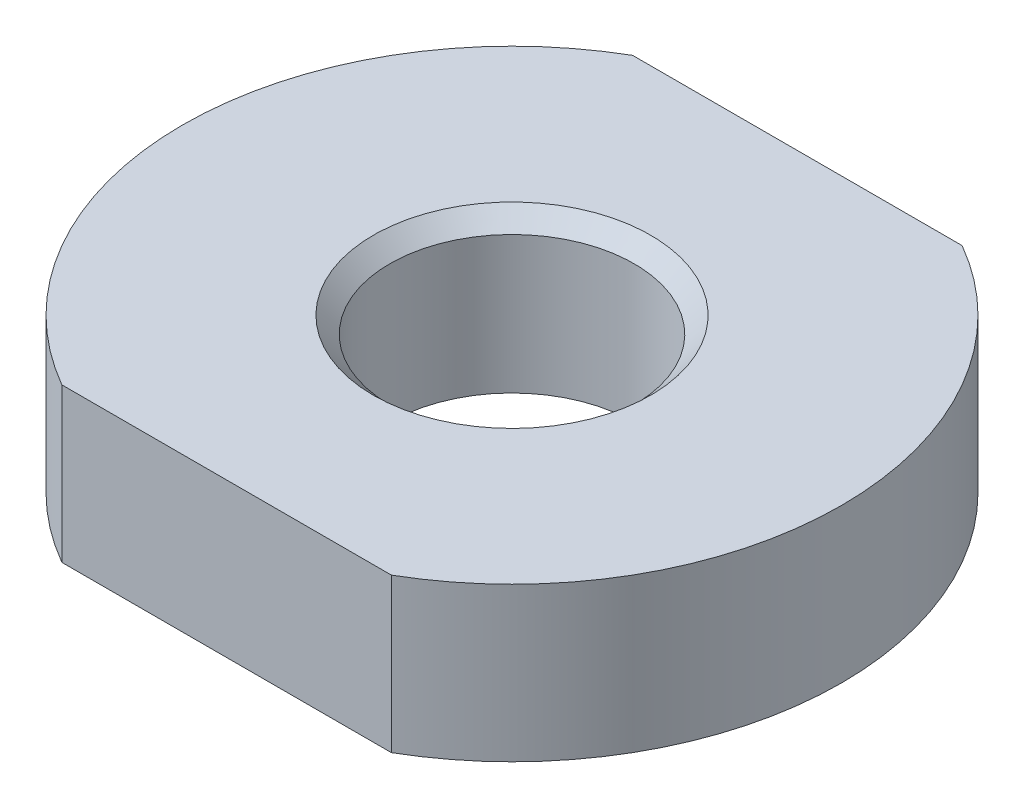
ISO-10303-21;
HEADER;
FILE_DESCRIPTION(('STEP AP214'),'2;1');
FILE_NAME('part.step','',(''),(''),'','','');
FILE_SCHEMA(('AUTOMOTIVE_DESIGN { 1 0 10303 214 1 1 1 1 }'));
ENDSEC;
DATA;
#1=APPLICATION_CONTEXT('core data for automotive mechanical design processes');
#2=APPLICATION_PROTOCOL_DEFINITION('international standard','automotive_design',2000,#1);
#3=PRODUCT_CONTEXT('',#1,'mechanical');
#4=PRODUCT('Part','Part','',(#3));
#5=PRODUCT_RELATED_PRODUCT_CATEGORY('part','',(#4));
#6=PRODUCT_DEFINITION_FORMATION('','',#4);
#7=PRODUCT_DEFINITION_CONTEXT('part definition',#1,'design');
#8=PRODUCT_DEFINITION('design','',#6,#7);
#9=PRODUCT_DEFINITION_SHAPE('','',#8);
#10=(LENGTH_UNIT() NAMED_UNIT(*) SI_UNIT(.MILLI.,.METRE.));
#11=(NAMED_UNIT(*) PLANE_ANGLE_UNIT() SI_UNIT($,.RADIAN.));
#12=(NAMED_UNIT(*) SI_UNIT($,.STERADIAN.) SOLID_ANGLE_UNIT());
#13=UNCERTAINTY_MEASURE_WITH_UNIT(LENGTH_MEASURE(1.E-05),#10,'distance_accuracy_value','');
#14=(GEOMETRIC_REPRESENTATION_CONTEXT(3) GLOBAL_UNCERTAINTY_ASSIGNED_CONTEXT((#13)) GLOBAL_UNIT_ASSIGNED_CONTEXT((#10,
#11,#12)) REPRESENTATION_CONTEXT('',''));
#15=CARTESIAN_POINT('',(0.,0.,0.));
#16=DIRECTION('',(0.,0.,1.));
#17=DIRECTION('',(1.,0.,0.));
#18=AXIS2_PLACEMENT_3D('',#15,#16,#17);
#19=CARTESIAN_POINT('',(0.,5.6,0.));
#20=DIRECTION('',(0.,1.,0.));
#21=DIRECTION('',(0.,0.,1.));
#22=AXIS2_PLACEMENT_3D('',#19,#20,#21);
#23=PLANE('',#22);
#24=CARTESIAN_POINT('',(0.,5.6,0.));
#25=DIRECTION('',(0.,1.,0.));
#26=DIRECTION('',(0.,0.,1.));
#27=AXIS2_PLACEMENT_3D('',#24,#25,#26);
#28=CIRCLE('',#27,5.05);
#29=CARTESIAN_POINT('',(0.,5.6,5.05));
#30=VERTEX_POINT('',#29);
#31=EDGE_CURVE('E11',#30,#30,#28,.F.);
#32=ORIENTED_EDGE('',*,*,#31,.T.);
#33=EDGE_LOOP('',(#32));
#34=FACE_BOUND('',#33,.T.);
#35=CARTESIAN_POINT('',(0.,5.6,0.));
#36=DIRECTION('',(0.,1.,0.));
#37=DIRECTION('',(0.,0.,1.));
#38=AXIS2_PLACEMENT_3D('',#35,#36,#37);
#39=CIRCLE('',#38,12.);
#40=CARTESIAN_POINT('',(6.,5.6,10.3923048454133));
#41=VERTEX_POINT('',#40);
#42=CARTESIAN_POINT('',(6.,5.6,-10.3923048454133));
#43=VERTEX_POINT('',#42);
#44=EDGE_CURVE('E94',#41,#43,#39,.T.);
#45=ORIENTED_EDGE('',*,*,#44,.T.);
#46=DIRECTION('',(-1.,0.,0.));
#47=VECTOR('',#46,1.);
#48=CARTESIAN_POINT('',(6.,5.6,-10.3923048454133));
#49=LINE('',#48,#47);
#50=CARTESIAN_POINT('',(-6.,5.6,-10.3923048454133));
#51=VERTEX_POINT('',#50);
#52=EDGE_CURVE('E90',#43,#51,#49,.T.);
#53=ORIENTED_EDGE('',*,*,#52,.T.);
#54=CARTESIAN_POINT('',(0.,5.6,0.));
#55=DIRECTION('',(0.,1.,0.));
#56=DIRECTION('',(0.,0.,1.));
#57=AXIS2_PLACEMENT_3D('',#54,#55,#56);
#58=CIRCLE('',#57,12.);
#59=CARTESIAN_POINT('',(-6.00000000000001,5.6,10.3923048454133));
#60=VERTEX_POINT('',#59);
#61=EDGE_CURVE('E92',#51,#60,#58,.T.);
#62=ORIENTED_EDGE('',*,*,#61,.T.);
#63=DIRECTION('',(1.,0.,0.));
#64=VECTOR('',#63,1.);
#65=CARTESIAN_POINT('',(6.,5.6,10.3923048454133));
#66=LINE('',#65,#64);
#67=EDGE_CURVE('E59',#60,#41,#66,.T.);
#68=ORIENTED_EDGE('',*,*,#67,.T.);
#69=EDGE_LOOP('',(#45,#53,#62,#68));
#70=FACE_BOUND('',#69,.T.);
#71=ADVANCED_FACE('F41',(#34,#70),#23,.T.);
#72=CARTESIAN_POINT('',(0.,0.,0.));
#73=DIRECTION('',(0.,1.,0.));
#74=DIRECTION('',(0.,0.,1.));
#75=AXIS2_PLACEMENT_3D('',#72,#73,#74);
#76=PLANE('',#75);
#77=CARTESIAN_POINT('',(0.,0.,0.));
#78=DIRECTION('',(0.,1.,0.));
#79=DIRECTION('',(0.,0.,1.));
#80=AXIS2_PLACEMENT_3D('',#77,#78,#79);
#81=CIRCLE('',#80,12.);
#82=CARTESIAN_POINT('',(6.,0.,10.3923048454133));
#83=VERTEX_POINT('',#82);
#84=CARTESIAN_POINT('',(6.,0.,-10.3923048454133));
#85=VERTEX_POINT('',#84);
#86=EDGE_CURVE('E109',#83,#85,#81,.T.);
#87=ORIENTED_EDGE('',*,*,#86,.F.);
#88=DIRECTION('',(1.,0.,0.));
#89=VECTOR('',#88,1.);
#90=CARTESIAN_POINT('',(6.,0.,10.3923048454133));
#91=LINE('',#90,#89);
#92=CARTESIAN_POINT('',(-6.00000000000001,0.,10.3923048454133));
#93=VERTEX_POINT('',#92);
#94=EDGE_CURVE('E82',#93,#83,#91,.T.);
#95=ORIENTED_EDGE('',*,*,#94,.F.);
#96=CARTESIAN_POINT('',(0.,0.,0.));
#97=DIRECTION('',(0.,1.,0.));
#98=DIRECTION('',(0.,0.,1.));
#99=AXIS2_PLACEMENT_3D('',#96,#97,#98);
#100=CIRCLE('',#99,12.);
#101=CARTESIAN_POINT('',(-6.,0.,-10.3923048454133));
#102=VERTEX_POINT('',#101);
#103=EDGE_CURVE('E76',#102,#93,#100,.T.);
#104=ORIENTED_EDGE('',*,*,#103,.F.);
#105=DIRECTION('',(-1.,0.,0.));
#106=VECTOR('',#105,1.);
#107=CARTESIAN_POINT('',(6.,0.,-10.3923048454133));
#108=LINE('',#107,#106);
#109=EDGE_CURVE('E99',#85,#102,#108,.T.);
#110=ORIENTED_EDGE('',*,*,#109,.F.);
#111=EDGE_LOOP('',(#87,#95,#104,#110));
#112=FACE_BOUND('',#111,.T.);
#113=CARTESIAN_POINT('',(0.,0.,0.));
#114=DIRECTION('',(0.,1.,0.));
#115=DIRECTION('',(0.,0.,1.));
#116=AXIS2_PLACEMENT_3D('',#113,#114,#115);
#117=CIRCLE('',#116,4.45);
#118=CARTESIAN_POINT('',(0.,0.,4.45));
#119=VERTEX_POINT('',#118);
#120=EDGE_CURVE('E112',#119,#119,#117,.T.);
#121=ORIENTED_EDGE('',*,*,#120,.T.);
#122=EDGE_LOOP('',(#121));
#123=FACE_BOUND('',#122,.T.);
#124=ADVANCED_FACE('F133',(#112,#123),#76,.F.);
#125=CARTESIAN_POINT('',(0.,5.6,0.));
#126=DIRECTION('',(0.,-1.,0.));
#127=DIRECTION('',(0.,0.,-1.));
#128=AXIS2_PLACEMENT_3D('',#125,#126,#127);
#129=CYLINDRICAL_SURFACE('',#128,12.);
#130=ORIENTED_EDGE('',*,*,#86,.T.);
#131=DIRECTION('',(0.,-1.,0.));
#132=VECTOR('',#131,1.);
#133=CARTESIAN_POINT('',(6.,5.6,-10.3923048454133));
#134=LINE('',#133,#132);
#135=EDGE_CURVE('E100',#43,#85,#134,.T.);
#136=ORIENTED_EDGE('',*,*,#135,.F.);
#137=ORIENTED_EDGE('',*,*,#44,.F.);
#138=DIRECTION('',(0.,-1.,0.));
#139=VECTOR('',#138,1.);
#140=CARTESIAN_POINT('',(6.,5.6,10.3923048454133));
#141=LINE('',#140,#139);
#142=EDGE_CURVE('E105',#41,#83,#141,.T.);
#143=ORIENTED_EDGE('',*,*,#142,.T.);
#144=EDGE_LOOP('',(#130,#136,#137,#143));
#145=FACE_BOUND('',#144,.T.);
#146=ADVANCED_FACE('F140',(#145),#129,.T.);
#147=CARTESIAN_POINT('',(6.,5.6,-10.3923048454133));
#148=DIRECTION('',(0.,0.,1.));
#149=DIRECTION('',(1.,0.,0.));
#150=AXIS2_PLACEMENT_3D('',#147,#148,#149);
#151=PLANE('',#150);
#152=ORIENTED_EDGE('',*,*,#109,.T.);
#153=DIRECTION('',(0.,-1.,0.));
#154=VECTOR('',#153,1.);
#155=CARTESIAN_POINT('',(-6.,5.6,-10.3923048454133));
#156=LINE('',#155,#154);
#157=EDGE_CURVE('E97',#51,#102,#156,.T.);
#158=ORIENTED_EDGE('',*,*,#157,.F.);
#159=ORIENTED_EDGE('',*,*,#52,.F.);
#160=ORIENTED_EDGE('',*,*,#135,.T.);
#161=EDGE_LOOP('',(#152,#158,#159,#160));
#162=FACE_BOUND('',#161,.T.);
#163=ADVANCED_FACE('F98',(#162),#151,.F.);
#164=CARTESIAN_POINT('',(0.,5.6,0.));
#165=DIRECTION('',(0.,-1.,0.));
#166=DIRECTION('',(0.,0.,-1.));
#167=AXIS2_PLACEMENT_3D('',#164,#165,#166);
#168=CYLINDRICAL_SURFACE('',#167,12.);
#169=ORIENTED_EDGE('',*,*,#103,.T.);
#170=DIRECTION('',(0.,-1.,0.));
#171=VECTOR('',#170,1.);
#172=CARTESIAN_POINT('',(-6.00000000000001,5.6,10.3923048454133));
#173=LINE('',#172,#171);
#174=EDGE_CURVE('E101',#60,#93,#173,.T.);
#175=ORIENTED_EDGE('',*,*,#174,.F.);
#176=ORIENTED_EDGE('',*,*,#61,.F.);
#177=ORIENTED_EDGE('',*,*,#157,.T.);
#178=EDGE_LOOP('',(#169,#175,#176,#177));
#179=FACE_BOUND('',#178,.T.);
#180=ADVANCED_FACE('F103',(#179),#168,.T.);
#181=CARTESIAN_POINT('',(6.,5.6,10.3923048454133));
#182=DIRECTION('',(0.,0.,-1.));
#183=DIRECTION('',(-1.,0.,0.));
#184=AXIS2_PLACEMENT_3D('',#181,#182,#183);
#185=PLANE('',#184);
#186=ORIENTED_EDGE('',*,*,#94,.T.);
#187=ORIENTED_EDGE('',*,*,#142,.F.);
#188=ORIENTED_EDGE('',*,*,#67,.F.);
#189=ORIENTED_EDGE('',*,*,#174,.T.);
#190=EDGE_LOOP('',(#186,#187,#188,#189));
#191=FACE_BOUND('',#190,.T.);
#192=ADVANCED_FACE('F129',(#191),#185,.F.);
#193=CARTESIAN_POINT('',(0.,5.6,0.));
#194=DIRECTION('',(0.,-1.,0.));
#195=DIRECTION('',(0.,0.,-1.));
#196=AXIS2_PLACEMENT_3D('',#193,#194,#195);
#197=CYLINDRICAL_SURFACE('',#196,4.45);
#198=CARTESIAN_POINT('',(0.,5.,0.));
#199=DIRECTION('',(0.,1.,0.));
#200=DIRECTION('',(0.,0.,1.));
#201=AXIS2_PLACEMENT_3D('',#198,#199,#200);
#202=CIRCLE('',#201,4.45);
#203=CARTESIAN_POINT('',(0.,5.,4.45));
#204=VERTEX_POINT('',#203);
#205=EDGE_CURVE('E51',#204,#204,#202,.T.);
#206=ORIENTED_EDGE('',*,*,#205,.T.);
#207=EDGE_LOOP('',(#206));
#208=FACE_BOUND('',#207,.T.);
#209=ORIENTED_EDGE('',*,*,#120,.F.);
#210=EDGE_LOOP('',(#209));
#211=FACE_BOUND('',#210,.T.);
#212=ADVANCED_FACE('F121',(#208,#211),#197,.F.);
#213=CARTESIAN_POINT('',(0.,5.,0.));
#214=DIRECTION('',(0.,1.,0.));
#215=DIRECTION('',(0.,0.,1.));
#216=AXIS2_PLACEMENT_3D('',#213,#214,#215);
#217=CONICAL_SURFACE('',#216,4.45,0.785398163397448);
#218=ORIENTED_EDGE('',*,*,#31,.F.);
#219=EDGE_LOOP('',(#218));
#220=FACE_BOUND('',#219,.T.);
#221=ORIENTED_EDGE('',*,*,#205,.F.);
#222=EDGE_LOOP('',(#221));
#223=FACE_BOUND('',#222,.T.);
#224=ADVANCED_FACE('F44',(#220,#223),#217,.F.);
#225=CLOSED_SHELL('',(#71,#124,#146,#163,#180,#192,#212,#224));
#226=MANIFOLD_SOLID_BREP('B2',#225);
#227=ADVANCED_BREP_SHAPE_REPRESENTATION('',(#18,#226),#14);
#228=SHAPE_DEFINITION_REPRESENTATION(#9,#227);
ENDSEC;
END-ISO-10303-21;
